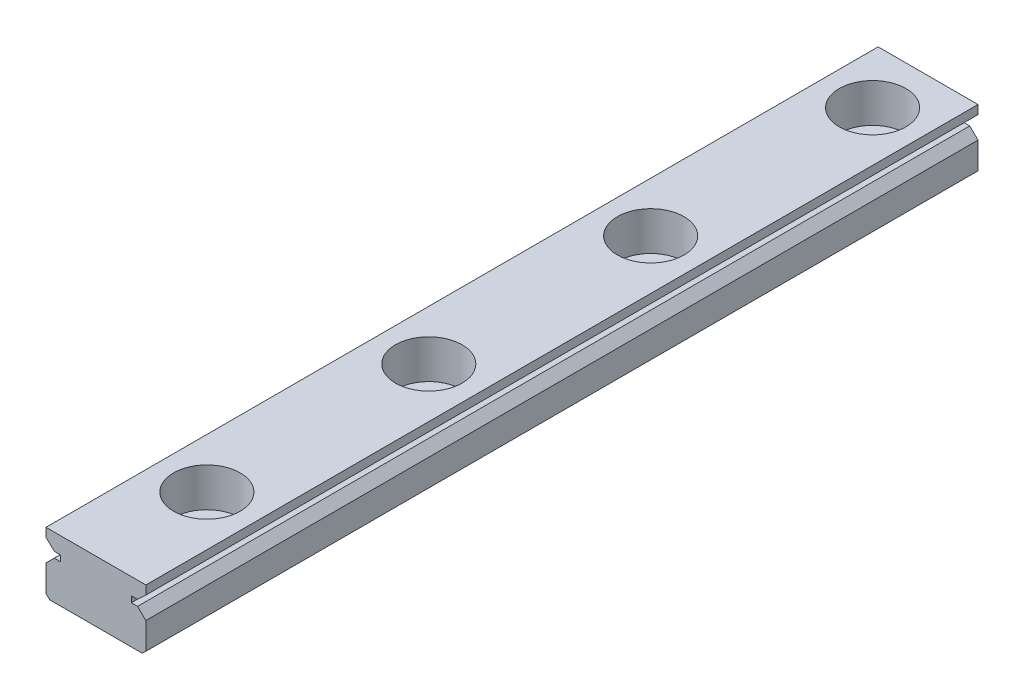
ISO-10303-21;
HEADER;
FILE_DESCRIPTION(('STEP AP214'),'2;1');
FILE_NAME('part.step','',(''),(''),'','','');
FILE_SCHEMA(('AUTOMOTIVE_DESIGN { 1 0 10303 214 1 1 1 1 }'));
ENDSEC;
DATA;
#1=APPLICATION_CONTEXT('core data for automotive mechanical design processes');
#2=APPLICATION_PROTOCOL_DEFINITION('international standard','automotive_design',2000,#1);
#3=PRODUCT_CONTEXT('',#1,'mechanical');
#4=PRODUCT('Part','Part','',(#3));
#5=PRODUCT_RELATED_PRODUCT_CATEGORY('part','',(#4));
#6=PRODUCT_DEFINITION_FORMATION('','',#4);
#7=PRODUCT_DEFINITION_CONTEXT('part definition',#1,'design');
#8=PRODUCT_DEFINITION('design','',#6,#7);
#9=PRODUCT_DEFINITION_SHAPE('','',#8);
#10=(LENGTH_UNIT() NAMED_UNIT(*) SI_UNIT(.MILLI.,.METRE.));
#11=(NAMED_UNIT(*) PLANE_ANGLE_UNIT() SI_UNIT($,.RADIAN.));
#12=(NAMED_UNIT(*) SI_UNIT($,.STERADIAN.) SOLID_ANGLE_UNIT());
#13=UNCERTAINTY_MEASURE_WITH_UNIT(LENGTH_MEASURE(1.E-05),#10,'distance_accuracy_value','');
#14=(GEOMETRIC_REPRESENTATION_CONTEXT(3) GLOBAL_UNCERTAINTY_ASSIGNED_CONTEXT((#13)) GLOBAL_UNIT_ASSIGNED_CONTEXT((#10,
#11,#12)) REPRESENTATION_CONTEXT('',''));
#15=CARTESIAN_POINT('',(0.,0.,0.));
#16=DIRECTION('',(0.,0.,1.));
#17=DIRECTION('',(1.,0.,0.));
#18=AXIS2_PLACEMENT_3D('',#15,#16,#17);
#19=CARTESIAN_POINT('',(0.,60.3558438126425,75.));
#20=DIRECTION('',(0.,-1.,0.));
#21=DIRECTION('',(0.,0.,-1.));
#22=AXIS2_PLACEMENT_3D('',#19,#20,#21);
#23=PLANE('',#22);
#24=CARTESIAN_POINT('',(176.62288373964,60.3558438126425,5.));
#25=DIRECTION('',(0.,1.,0.));
#26=DIRECTION('',(0.,0.,1.));
#27=AXIS2_PLACEMENT_3D('',#24,#25,#26);
#28=CIRCLE('',#27,3.);
#29=CARTESIAN_POINT('',(176.62288373964,60.3558438126425,8.));
#30=VERTEX_POINT('',#29);
#31=EDGE_CURVE('E342',#30,#30,#28,.T.);
#32=ORIENTED_EDGE('',*,*,#31,.F.);
#33=EDGE_LOOP('',(#32));
#34=FACE_BOUND('',#33,.T.);
#35=CARTESIAN_POINT('',(176.62288373964,60.3558438126425,25.));
#36=DIRECTION('',(0.,1.,0.));
#37=DIRECTION('',(0.,0.,1.));
#38=AXIS2_PLACEMENT_3D('',#35,#36,#37);
#39=CIRCLE('',#38,3.);
#40=CARTESIAN_POINT('',(176.62288373964,60.3558438126425,28.));
#41=VERTEX_POINT('',#40);
#42=EDGE_CURVE('E346',#41,#41,#39,.T.);
#43=ORIENTED_EDGE('',*,*,#42,.F.);
#44=EDGE_LOOP('',(#43));
#45=FACE_BOUND('',#44,.T.);
#46=CARTESIAN_POINT('',(176.62288373964,60.3558438126425,45.));
#47=DIRECTION('',(0.,1.,0.));
#48=DIRECTION('',(0.,0.,1.));
#49=AXIS2_PLACEMENT_3D('',#46,#47,#48);
#50=CIRCLE('',#49,3.);
#51=CARTESIAN_POINT('',(176.62288373964,60.3558438126425,48.));
#52=VERTEX_POINT('',#51);
#53=EDGE_CURVE('E350',#52,#52,#50,.T.);
#54=ORIENTED_EDGE('',*,*,#53,.F.);
#55=EDGE_LOOP('',(#54));
#56=FACE_BOUND('',#55,.T.);
#57=CARTESIAN_POINT('',(176.62288373964,60.3558438126425,65.));
#58=DIRECTION('',(0.,1.,0.));
#59=DIRECTION('',(0.,0.,1.));
#60=AXIS2_PLACEMENT_3D('',#57,#58,#59);
#61=CIRCLE('',#60,3.);
#62=CARTESIAN_POINT('',(176.62288373964,60.3558438126425,68.));
#63=VERTEX_POINT('',#62);
#64=EDGE_CURVE('E353',#63,#63,#61,.T.);
#65=ORIENTED_EDGE('',*,*,#64,.F.);
#66=EDGE_LOOP('',(#65));
#67=FACE_BOUND('',#66,.T.);
#68=DIRECTION('',(-1.,0.,0.));
#69=VECTOR('',#68,1.);
#70=CARTESIAN_POINT('',(0.,60.3558438126425,0.));
#71=LINE('',#70,#69);
#72=CARTESIAN_POINT('',(181.122753743396,60.3558438126425,0.));
#73=VERTEX_POINT('',#72);
#74=CARTESIAN_POINT('',(172.123013735885,60.3558438126425,0.));
#75=VERTEX_POINT('',#74);
#76=EDGE_CURVE('E187',#73,#75,#71,.T.);
#77=ORIENTED_EDGE('',*,*,#76,.T.);
#78=DIRECTION('',(0.,0.,-1.));
#79=VECTOR('',#78,1.);
#80=CARTESIAN_POINT('',(172.123013735885,60.3558438126425,75.));
#81=LINE('',#80,#79);
#82=CARTESIAN_POINT('',(172.123013735885,60.3558438126425,75.));
#83=VERTEX_POINT('',#82);
#84=EDGE_CURVE('E11',#83,#75,#81,.T.);
#85=ORIENTED_EDGE('',*,*,#84,.F.);
#86=DIRECTION('',(-1.,0.,0.));
#87=VECTOR('',#86,1.);
#88=CARTESIAN_POINT('',(0.,60.3558438126425,75.));
#89=LINE('',#88,#87);
#90=CARTESIAN_POINT('',(181.122753743396,60.3558438126425,75.));
#91=VERTEX_POINT('',#90);
#92=EDGE_CURVE('E118',#91,#83,#89,.T.);
#93=ORIENTED_EDGE('',*,*,#92,.F.);
#94=DIRECTION('',(0.,0.,-1.));
#95=VECTOR('',#94,1.);
#96=CARTESIAN_POINT('',(181.122753743396,60.3558438126425,75.));
#97=LINE('',#96,#95);
#98=EDGE_CURVE('E183',#91,#73,#97,.T.);
#99=ORIENTED_EDGE('',*,*,#98,.T.);
#100=EDGE_LOOP('',(#77,#85,#93,#99));
#101=FACE_BOUND('',#100,.T.);
#102=ADVANCED_FACE('F32',(#34,#45,#56,#67,#101),#23,.F.);
#103=CARTESIAN_POINT('',(172.123013735885,0.,75.));
#104=DIRECTION('',(-1.,0.,0.));
#105=DIRECTION('',(0.,0.,1.));
#106=AXIS2_PLACEMENT_3D('',#103,#104,#105);
#107=PLANE('',#106);
#108=DIRECTION('',(0.,1.,0.));
#109=VECTOR('',#108,1.);
#110=CARTESIAN_POINT('',(172.123013735885,0.,0.));
#111=LINE('',#110,#109);
#112=CARTESIAN_POINT('',(172.123013735885,59.5630289463369,0.));
#113=VERTEX_POINT('',#112);
#114=EDGE_CURVE('E190',#113,#75,#111,.T.);
#115=ORIENTED_EDGE('',*,*,#114,.F.);
#116=DIRECTION('',(0.,0.,-1.));
#117=VECTOR('',#116,1.);
#118=CARTESIAN_POINT('',(172.123013735885,59.5630289463369,75.));
#119=LINE('',#118,#117);
#120=CARTESIAN_POINT('',(172.123013735885,59.5630289463369,75.));
#121=VERTEX_POINT('',#120);
#122=EDGE_CURVE('E40',#121,#113,#119,.T.);
#123=ORIENTED_EDGE('',*,*,#122,.F.);
#124=DIRECTION('',(0.,1.,0.));
#125=VECTOR('',#124,1.);
#126=CARTESIAN_POINT('',(172.123013735885,0.,75.));
#127=LINE('',#126,#125);
#128=EDGE_CURVE('E283',#121,#83,#127,.T.);
#129=ORIENTED_EDGE('',*,*,#128,.T.);
#130=ORIENTED_EDGE('',*,*,#84,.T.);
#131=EDGE_LOOP('',(#115,#123,#129,#130));
#132=FACE_BOUND('',#131,.T.);
#133=ADVANCED_FACE('F270',(#132),#107,.T.);
#134=CARTESIAN_POINT('',(110.707011310501,117.452037908747,75.));
#135=DIRECTION('',(-0.685903044724634,-0.727692938839918,0.));
#136=DIRECTION('',(0.727692938839918,-0.685903044724634,0.));
#137=AXIS2_PLACEMENT_3D('',#134,#135,#136);
#138=PLANE('',#137);
#139=DIRECTION('',(-0.727692938839918,0.685903044724634,0.));
#140=VECTOR('',#139,1.);
#141=CARTESIAN_POINT('',(110.707011310501,117.452037908747,0.));
#142=LINE('',#141,#140);
#143=CARTESIAN_POINT('',(172.878991896515,58.8504650413625,0.));
#144=VERTEX_POINT('',#143);
#145=EDGE_CURVE('E194',#144,#113,#142,.T.);
#146=ORIENTED_EDGE('',*,*,#145,.F.);
#147=DIRECTION('',(0.,0.,-1.));
#148=VECTOR('',#147,1.);
#149=CARTESIAN_POINT('',(172.878991896515,58.8504650413625,75.));
#150=LINE('',#149,#148);
#151=CARTESIAN_POINT('',(172.878991896515,58.8504650413625,75.));
#152=VERTEX_POINT('',#151);
#153=EDGE_CURVE('E260',#152,#144,#150,.T.);
#154=ORIENTED_EDGE('',*,*,#153,.F.);
#155=DIRECTION('',(-0.727692938839918,0.685903044724634,0.));
#156=VECTOR('',#155,1.);
#157=CARTESIAN_POINT('',(110.707011310501,117.452037908747,75.));
#158=LINE('',#157,#156);
#159=EDGE_CURVE('E267',#152,#121,#158,.T.);
#160=ORIENTED_EDGE('',*,*,#159,.T.);
#161=ORIENTED_EDGE('',*,*,#122,.T.);
#162=EDGE_LOOP('',(#146,#154,#160,#161));
#163=FACE_BOUND('',#162,.T.);
#164=ADVANCED_FACE('F265',(#163),#138,.T.);
#165=CARTESIAN_POINT('',(0.,58.8504650413625,75.));
#166=DIRECTION('',(0.,-1.,0.));
#167=DIRECTION('',(0.,0.,-1.));
#168=AXIS2_PLACEMENT_3D('',#165,#166,#167);
#169=PLANE('',#168);
#170=DIRECTION('',(-1.,0.,0.));
#171=VECTOR('',#170,1.);
#172=CARTESIAN_POINT('',(0.,58.8504650413625,0.));
#173=LINE('',#172,#171);
#174=CARTESIAN_POINT('',(173.430975950309,58.8504650413625,0.));
#175=VERTEX_POINT('',#174);
#176=EDGE_CURVE('E197',#175,#144,#173,.T.);
#177=ORIENTED_EDGE('',*,*,#176,.F.);
#178=DIRECTION('',(0.,0.,-1.));
#179=VECTOR('',#178,1.);
#180=CARTESIAN_POINT('',(173.430975950309,58.8504650413625,75.));
#181=LINE('',#180,#179);
#182=CARTESIAN_POINT('',(173.430975950309,58.8504650413625,75.));
#183=VERTEX_POINT('',#182);
#184=EDGE_CURVE('E258',#183,#175,#181,.T.);
#185=ORIENTED_EDGE('',*,*,#184,.F.);
#186=DIRECTION('',(-1.,0.,0.));
#187=VECTOR('',#186,1.);
#188=CARTESIAN_POINT('',(0.,58.8504650413625,75.));
#189=LINE('',#188,#187);
#190=EDGE_CURVE('E280',#183,#152,#189,.T.);
#191=ORIENTED_EDGE('',*,*,#190,.T.);
#192=ORIENTED_EDGE('',*,*,#153,.T.);
#193=EDGE_LOOP('',(#177,#185,#191,#192));
#194=FACE_BOUND('',#193,.T.);
#195=ADVANCED_FACE('F277',(#194),#169,.T.);
#196=CARTESIAN_POINT('',(173.430975950309,0.,75.));
#197=DIRECTION('',(-1.,0.,0.));
#198=DIRECTION('',(0.,0.,1.));
#199=AXIS2_PLACEMENT_3D('',#196,#197,#198);
#200=PLANE('',#199);
#201=DIRECTION('',(0.,1.,0.));
#202=VECTOR('',#201,1.);
#203=CARTESIAN_POINT('',(173.430975950309,0.,0.));
#204=LINE('',#203,#202);
#205=CARTESIAN_POINT('',(173.430975950309,58.3136633089681,0.));
#206=VERTEX_POINT('',#205);
#207=EDGE_CURVE('E200',#206,#175,#204,.T.);
#208=ORIENTED_EDGE('',*,*,#207,.F.);
#209=DIRECTION('',(0.,0.,-1.));
#210=VECTOR('',#209,1.);
#211=CARTESIAN_POINT('',(173.430975950309,58.3136633089681,75.));
#212=LINE('',#211,#210);
#213=CARTESIAN_POINT('',(173.430975950309,58.3136633089681,75.));
#214=VERTEX_POINT('',#213);
#215=EDGE_CURVE('E256',#214,#206,#212,.T.);
#216=ORIENTED_EDGE('',*,*,#215,.F.);
#217=DIRECTION('',(0.,1.,0.));
#218=VECTOR('',#217,1.);
#219=CARTESIAN_POINT('',(173.430975950309,0.,75.));
#220=LINE('',#219,#218);
#221=EDGE_CURVE('E285',#214,#183,#220,.T.);
#222=ORIENTED_EDGE('',*,*,#221,.T.);
#223=ORIENTED_EDGE('',*,*,#184,.T.);
#224=EDGE_LOOP('',(#208,#216,#222,#223));
#225=FACE_BOUND('',#224,.T.);
#226=ADVANCED_FACE('F406',(#225),#200,.T.);
#227=CARTESIAN_POINT('',(0.,58.3136633089681,75.));
#228=DIRECTION('',(0.,1.,0.));
#229=DIRECTION('',(0.,0.,1.));
#230=AXIS2_PLACEMENT_3D('',#227,#228,#229);
#231=PLANE('',#230);
#232=DIRECTION('',(1.,0.,0.));
#233=VECTOR('',#232,1.);
#234=CARTESIAN_POINT('',(0.,58.3136633089681,0.));
#235=LINE('',#234,#233);
#236=CARTESIAN_POINT('',(172.866992243172,58.3136633089681,0.));
#237=VERTEX_POINT('',#236);
#238=EDGE_CURVE('E203',#237,#206,#235,.T.);
#239=ORIENTED_EDGE('',*,*,#238,.F.);
#240=DIRECTION('',(0.,0.,-1.));
#241=VECTOR('',#240,1.);
#242=CARTESIAN_POINT('',(172.866992243172,58.3136633089681,75.));
#243=LINE('',#242,#241);
#244=CARTESIAN_POINT('',(172.866992243172,58.3136633089681,75.));
#245=VERTEX_POINT('',#244);
#246=EDGE_CURVE('E254',#245,#237,#243,.T.);
#247=ORIENTED_EDGE('',*,*,#246,.F.);
#248=DIRECTION('',(1.,0.,0.));
#249=VECTOR('',#248,1.);
#250=CARTESIAN_POINT('',(0.,58.3136633089681,75.));
#251=LINE('',#250,#249);
#252=EDGE_CURVE('E291',#245,#214,#251,.T.);
#253=ORIENTED_EDGE('',*,*,#252,.T.);
#254=ORIENTED_EDGE('',*,*,#215,.T.);
#255=EDGE_LOOP('',(#239,#247,#253,#254));
#256=FACE_BOUND('',#255,.T.);
#257=ADVANCED_FACE('F403',(#256),#231,.T.);
#258=CARTESIAN_POINT('',(56.2293907047499,-56.9162890040398,75.));
#259=DIRECTION('',(-0.702801041807441,0.711386460114596,0.));
#260=DIRECTION('',(-0.711386460114596,-0.702801041807441,0.));
#261=AXIS2_PLACEMENT_3D('',#258,#259,#260);
#262=PLANE('',#261);
#263=DIRECTION('',(0.711386460114596,0.702801041807441,0.));
#264=VECTOR('',#263,1.);
#265=CARTESIAN_POINT('',(56.2293907047499,-56.9162890040398,0.));
#266=LINE('',#265,#264);
#267=CARTESIAN_POINT('',(172.123013735885,57.5786635594371,0.));
#268=VERTEX_POINT('',#267);
#269=EDGE_CURVE('E206',#268,#237,#266,.T.);
#270=ORIENTED_EDGE('',*,*,#269,.F.);
#271=DIRECTION('',(0.,0.,-1.));
#272=VECTOR('',#271,1.);
#273=CARTESIAN_POINT('',(172.123013735885,57.5786635594371,75.));
#274=LINE('',#273,#272);
#275=CARTESIAN_POINT('',(172.123013735885,57.5786635594371,75.));
#276=VERTEX_POINT('',#275);
#277=EDGE_CURVE('E252',#276,#268,#274,.T.);
#278=ORIENTED_EDGE('',*,*,#277,.F.);
#279=DIRECTION('',(0.711386460114596,0.702801041807441,0.));
#280=VECTOR('',#279,1.);
#281=CARTESIAN_POINT('',(56.2293907047499,-56.9162890040398,75.));
#282=LINE('',#281,#280);
#283=EDGE_CURVE('E294',#276,#245,#282,.T.);
#284=ORIENTED_EDGE('',*,*,#283,.T.);
#285=ORIENTED_EDGE('',*,*,#246,.T.);
#286=EDGE_LOOP('',(#270,#278,#284,#285));
#287=FACE_BOUND('',#286,.T.);
#288=ADVANCED_FACE('F400',(#287),#262,.T.);
#289=CARTESIAN_POINT('',(172.123013735885,0.,75.));
#290=DIRECTION('',(-1.,0.,0.));
#291=DIRECTION('',(0.,0.,1.));
#292=AXIS2_PLACEMENT_3D('',#289,#290,#291);
#293=PLANE('',#292);
#294=DIRECTION('',(0.,1.,0.));
#295=VECTOR('',#294,1.);
#296=CARTESIAN_POINT('',(172.123013735885,0.,0.));
#297=LINE('',#296,#295);
#298=CARTESIAN_POINT('',(172.123013735885,55.1745401347487,0.));
#299=VERTEX_POINT('',#298);
#300=EDGE_CURVE('E209',#299,#268,#297,.T.);
#301=ORIENTED_EDGE('',*,*,#300,.F.);
#302=DIRECTION('',(0.,0.,-1.));
#303=VECTOR('',#302,1.);
#304=CARTESIAN_POINT('',(172.123013735885,55.1745401347487,75.));
#305=LINE('',#304,#303);
#306=CARTESIAN_POINT('',(172.123013735885,55.1745401347487,75.));
#307=VERTEX_POINT('',#306);
#308=EDGE_CURVE('E250',#307,#299,#305,.T.);
#309=ORIENTED_EDGE('',*,*,#308,.F.);
#310=DIRECTION('',(0.,1.,0.));
#311=VECTOR('',#310,1.);
#312=CARTESIAN_POINT('',(172.123013735885,0.,75.));
#313=LINE('',#312,#311);
#314=EDGE_CURVE('E297',#307,#276,#313,.T.);
#315=ORIENTED_EDGE('',*,*,#314,.T.);
#316=ORIENTED_EDGE('',*,*,#277,.T.);
#317=EDGE_LOOP('',(#301,#309,#315,#316));
#318=FACE_BOUND('',#317,.T.);
#319=ADVANCED_FACE('F397',(#318),#293,.T.);
#320=CARTESIAN_POINT('',(105.735463596551,115.794842649279,75.));
#321=DIRECTION('',(0.674303230167207,0.738454571240554,0.));
#322=DIRECTION('',(-0.738454571240554,0.674303230167207,0.));
#323=AXIS2_PLACEMENT_3D('',#320,#321,#322);
#324=PLANE('',#323);
#325=DIRECTION('',(0.738454571240554,-0.674303230167207,0.));
#326=VECTOR('',#325,1.);
#327=CARTESIAN_POINT('',(105.735463596551,115.794842649279,0.));
#328=LINE('',#327,#326);
#329=CARTESIAN_POINT('',(172.467003798394,54.8604333239455,0.));
#330=VERTEX_POINT('',#329);
#331=EDGE_CURVE('E212',#299,#330,#328,.T.);
#332=ORIENTED_EDGE('',*,*,#331,.T.);
#333=DIRECTION('',(0.,0.,-1.));
#334=VECTOR('',#333,1.);
#335=CARTESIAN_POINT('',(172.467003798394,54.8604333239455,75.));
#336=LINE('',#335,#334);
#337=CARTESIAN_POINT('',(172.467003798394,54.8604333239455,75.));
#338=VERTEX_POINT('',#337);
#339=EDGE_CURVE('E248',#338,#330,#336,.T.);
#340=ORIENTED_EDGE('',*,*,#339,.F.);
#341=DIRECTION('',(0.738454571240554,-0.674303230167207,0.));
#342=VECTOR('',#341,1.);
#343=CARTESIAN_POINT('',(105.735463596551,115.794842649279,75.));
#344=LINE('',#343,#342);
#345=EDGE_CURVE('E300',#307,#338,#344,.T.);
#346=ORIENTED_EDGE('',*,*,#345,.F.);
#347=ORIENTED_EDGE('',*,*,#308,.T.);
#348=EDGE_LOOP('',(#332,#340,#346,#347));
#349=FACE_BOUND('',#348,.T.);
#350=ADVANCED_FACE('F377',(#349),#324,.F.);
#351=CARTESIAN_POINT('',(0.,54.8604333239455,75.));
#352=DIRECTION('',(0.,-1.,0.));
#353=DIRECTION('',(0.,0.,-1.));
#354=AXIS2_PLACEMENT_3D('',#351,#352,#353);
#355=PLANE('',#354);
#356=CARTESIAN_POINT('',(176.62288373964,54.8604333239455,5.));
#357=DIRECTION('',(0.,-1.,0.));
#358=DIRECTION('',(0.,0.,-1.));
#359=AXIS2_PLACEMENT_3D('',#356,#357,#358);
#360=CIRCLE('',#359,1.75);
#361=CARTESIAN_POINT('',(176.62288373964,54.8604333239455,3.25));
#362=VERTEX_POINT('',#361);
#363=EDGE_CURVE('E690',#362,#362,#360,.T.);
#364=ORIENTED_EDGE('',*,*,#363,.F.);
#365=EDGE_LOOP('',(#364));
#366=FACE_BOUND('',#365,.T.);
#367=CARTESIAN_POINT('',(176.62288373964,54.8604333239455,25.));
#368=DIRECTION('',(0.,-1.,0.));
#369=DIRECTION('',(0.,0.,-1.));
#370=AXIS2_PLACEMENT_3D('',#367,#368,#369);
#371=CIRCLE('',#370,1.75);
#372=CARTESIAN_POINT('',(176.62288373964,54.8604333239455,23.25));
#373=VERTEX_POINT('',#372);
#374=EDGE_CURVE('E700',#373,#373,#371,.T.);
#375=ORIENTED_EDGE('',*,*,#374,.F.);
#376=EDGE_LOOP('',(#375));
#377=FACE_BOUND('',#376,.T.);
#378=CARTESIAN_POINT('',(176.62288373964,54.8604333239455,45.));
#379=DIRECTION('',(0.,-1.,0.));
#380=DIRECTION('',(0.,0.,-1.));
#381=AXIS2_PLACEMENT_3D('',#378,#379,#380);
#382=CIRCLE('',#381,1.75);
#383=CARTESIAN_POINT('',(176.62288373964,54.8604333239455,43.25));
#384=VERTEX_POINT('',#383);
#385=EDGE_CURVE('E356',#384,#384,#382,.T.);
#386=ORIENTED_EDGE('',*,*,#385,.F.);
#387=EDGE_LOOP('',(#386));
#388=FACE_BOUND('',#387,.T.);
#389=CARTESIAN_POINT('',(176.62288373964,54.8604333239455,65.));
#390=DIRECTION('',(0.,-1.,0.));
#391=DIRECTION('',(0.,0.,-1.));
#392=AXIS2_PLACEMENT_3D('',#389,#390,#391);
#393=CIRCLE('',#392,1.75);
#394=CARTESIAN_POINT('',(176.62288373964,54.8604333239455,63.25));
#395=VERTEX_POINT('',#394);
#396=EDGE_CURVE('E191',#395,#395,#393,.T.);
#397=ORIENTED_EDGE('',*,*,#396,.F.);
#398=EDGE_LOOP('',(#397));
#399=FACE_BOUND('',#398,.T.);
#400=DIRECTION('',(-1.,0.,0.));
#401=VECTOR('',#400,1.);
#402=CARTESIAN_POINT('',(0.,54.8604333239455,0.));
#403=LINE('',#402,#401);
#404=CARTESIAN_POINT('',(180.778763680886,54.8604333239455,0.));
#405=VERTEX_POINT('',#404);
#406=EDGE_CURVE('E215',#405,#330,#403,.T.);
#407=ORIENTED_EDGE('',*,*,#406,.F.);
#408=DIRECTION('',(0.,0.,-1.));
#409=VECTOR('',#408,1.);
#410=CARTESIAN_POINT('',(180.778763680886,54.8604333239455,75.));
#411=LINE('',#410,#409);
#412=CARTESIAN_POINT('',(180.778763680886,54.8604333239455,75.));
#413=VERTEX_POINT('',#412);
#414=EDGE_CURVE('E246',#413,#405,#411,.T.);
#415=ORIENTED_EDGE('',*,*,#414,.F.);
#416=DIRECTION('',(-1.,0.,0.));
#417=VECTOR('',#416,1.);
#418=CARTESIAN_POINT('',(0.,54.8604333239455,75.));
#419=LINE('',#418,#417);
#420=EDGE_CURVE('E302',#413,#338,#419,.T.);
#421=ORIENTED_EDGE('',*,*,#420,.T.);
#422=ORIENTED_EDGE('',*,*,#339,.T.);
#423=EDGE_LOOP('',(#407,#415,#421,#422));
#424=FACE_BOUND('',#423,.T.);
#425=ADVANCED_FACE('F373',(#366,#377,#388,#399,#424),#355,.T.);
#426=CARTESIAN_POINT('',(54.880033865487,-60.101168235181,75.));
#427=DIRECTION('',(0.674303230167207,-0.738454571240554,0.));
#428=DIRECTION('',(0.738454571240554,0.674303230167207,0.));
#429=AXIS2_PLACEMENT_3D('',#426,#427,#428);
#430=PLANE('',#429);
#431=DIRECTION('',(-0.738454571240554,-0.674303230167207,0.));
#432=VECTOR('',#431,1.);
#433=CARTESIAN_POINT('',(54.880033865487,-60.101168235181,0.));
#434=LINE('',#433,#432);
#435=CARTESIAN_POINT('',(181.122753743396,55.1745401347487,0.));
#436=VERTEX_POINT('',#435);
#437=EDGE_CURVE('E218',#436,#405,#434,.T.);
#438=ORIENTED_EDGE('',*,*,#437,.F.);
#439=DIRECTION('',(0.,0.,-1.));
#440=VECTOR('',#439,1.);
#441=CARTESIAN_POINT('',(181.122753743396,55.1745401347487,75.));
#442=LINE('',#441,#440);
#443=CARTESIAN_POINT('',(181.122753743396,55.1745401347487,75.));
#444=VERTEX_POINT('',#443);
#445=EDGE_CURVE('E244',#444,#436,#442,.T.);
#446=ORIENTED_EDGE('',*,*,#445,.F.);
#447=DIRECTION('',(-0.738454571240554,-0.674303230167207,0.));
#448=VECTOR('',#447,1.);
#449=CARTESIAN_POINT('',(54.880033865487,-60.101168235181,75.));
#450=LINE('',#449,#448);
#451=EDGE_CURVE('E305',#444,#413,#450,.T.);
#452=ORIENTED_EDGE('',*,*,#451,.T.);
#453=ORIENTED_EDGE('',*,*,#414,.T.);
#454=EDGE_LOOP('',(#438,#446,#452,#453));
#455=FACE_BOUND('',#454,.T.);
#456=ADVANCED_FACE('F376',(#455),#430,.T.);
#457=CARTESIAN_POINT('',(181.122753743396,0.,75.));
#458=DIRECTION('',(-1.,0.,0.));
#459=DIRECTION('',(0.,0.,1.));
#460=AXIS2_PLACEMENT_3D('',#457,#458,#459);
#461=PLANE('',#460);
#462=DIRECTION('',(0.,1.,0.));
#463=VECTOR('',#462,1.);
#464=CARTESIAN_POINT('',(181.122753743396,0.,0.));
#465=LINE('',#464,#463);
#466=CARTESIAN_POINT('',(181.122753743396,57.5786635594371,0.));
#467=VERTEX_POINT('',#466);
#468=EDGE_CURVE('E221',#436,#467,#465,.T.);
#469=ORIENTED_EDGE('',*,*,#468,.T.);
#470=DIRECTION('',(0.,0.,-1.));
#471=VECTOR('',#470,1.);
#472=CARTESIAN_POINT('',(181.122753743396,57.5786635594371,75.));
#473=LINE('',#472,#471);
#474=CARTESIAN_POINT('',(181.122753743396,57.5786635594371,75.));
#475=VERTEX_POINT('',#474);
#476=EDGE_CURVE('E241',#475,#467,#473,.T.);
#477=ORIENTED_EDGE('',*,*,#476,.F.);
#478=DIRECTION('',(0.,1.,0.));
#479=VECTOR('',#478,1.);
#480=CARTESIAN_POINT('',(181.122753743396,0.,75.));
#481=LINE('',#480,#479);
#482=EDGE_CURVE('E308',#444,#475,#481,.T.);
#483=ORIENTED_EDGE('',*,*,#482,.F.);
#484=ORIENTED_EDGE('',*,*,#445,.T.);
#485=EDGE_LOOP('',(#469,#477,#483,#484));
#486=FACE_BOUND('',#485,.T.);
#487=ADVANCED_FACE('F469',(#486),#461,.F.);
#488=CARTESIAN_POINT('',(118.249294646824,119.693500080728,75.));
#489=DIRECTION('',(-0.702802016691502,-0.711385496994673,0.));
#490=DIRECTION('',(0.711385496994673,-0.702802016691502,0.));
#491=AXIS2_PLACEMENT_3D('',#488,#489,#490);
#492=PLANE('',#491);
#493=DIRECTION('',(-0.711385496994673,0.702802016691502,0.));
#494=VECTOR('',#493,1.);
#495=CARTESIAN_POINT('',(118.249294646824,119.693500080728,0.));
#496=LINE('',#495,#494);
#497=CARTESIAN_POINT('',(180.378777275353,58.3136633089681,0.));
#498=VERTEX_POINT('',#497);
#499=EDGE_CURVE('E223',#467,#498,#496,.T.);
#500=ORIENTED_EDGE('',*,*,#499,.T.);
#501=DIRECTION('',(0.,0.,-1.));
#502=VECTOR('',#501,1.);
#503=CARTESIAN_POINT('',(180.378777275353,58.3136633089681,75.));
#504=LINE('',#503,#502);
#505=CARTESIAN_POINT('',(180.378777275353,58.3136633089681,75.));
#506=VERTEX_POINT('',#505);
#507=EDGE_CURVE('E238',#506,#498,#504,.T.);
#508=ORIENTED_EDGE('',*,*,#507,.F.);
#509=DIRECTION('',(-0.711385496994673,0.702802016691502,0.));
#510=VECTOR('',#509,1.);
#511=CARTESIAN_POINT('',(118.249294646824,119.693500080728,75.));
#512=LINE('',#511,#510);
#513=EDGE_CURVE('E310',#475,#506,#512,.T.);
#514=ORIENTED_EDGE('',*,*,#513,.F.);
#515=ORIENTED_EDGE('',*,*,#476,.T.);
#516=EDGE_LOOP('',(#500,#508,#514,#515));
#517=FACE_BOUND('',#516,.T.);
#518=ADVANCED_FACE('F479',(#517),#492,.F.);
#519=CARTESIAN_POINT('',(0.,58.3136633089681,75.));
#520=DIRECTION('',(0.,-1.,0.));
#521=DIRECTION('',(0.,0.,-1.));
#522=AXIS2_PLACEMENT_3D('',#519,#520,#521);
#523=PLANE('',#522);
#524=DIRECTION('',(-1.,0.,0.));
#525=VECTOR('',#524,1.);
#526=CARTESIAN_POINT('',(0.,58.3136633089681,0.));
#527=LINE('',#526,#525);
#528=CARTESIAN_POINT('',(179.81479152897,58.3136633089681,0.));
#529=VERTEX_POINT('',#528);
#530=EDGE_CURVE('E225',#498,#529,#527,.T.);
#531=ORIENTED_EDGE('',*,*,#530,.T.);
#532=DIRECTION('',(0.,0.,-1.));
#533=VECTOR('',#532,1.);
#534=CARTESIAN_POINT('',(179.81479152897,58.3136633089681,75.));
#535=LINE('',#534,#533);
#536=CARTESIAN_POINT('',(179.81479152897,58.3136633089681,75.));
#537=VERTEX_POINT('',#536);
#538=EDGE_CURVE('E235',#537,#529,#535,.T.);
#539=ORIENTED_EDGE('',*,*,#538,.F.);
#540=DIRECTION('',(-1.,0.,0.));
#541=VECTOR('',#540,1.);
#542=CARTESIAN_POINT('',(0.,58.3136633089681,75.));
#543=LINE('',#542,#541);
#544=EDGE_CURVE('E312',#506,#537,#543,.T.);
#545=ORIENTED_EDGE('',*,*,#544,.F.);
#546=ORIENTED_EDGE('',*,*,#507,.T.);
#547=EDGE_LOOP('',(#531,#539,#545,#546));
#548=FACE_BOUND('',#547,.T.);
#549=ADVANCED_FACE('F318',(#548),#523,.F.);
#550=CARTESIAN_POINT('',(179.81479152897,0.,75.));
#551=DIRECTION('',(-1.,0.,0.));
#552=DIRECTION('',(0.,0.,1.));
#553=AXIS2_PLACEMENT_3D('',#550,#551,#552);
#554=PLANE('',#553);
#555=DIRECTION('',(0.,1.,0.));
#556=VECTOR('',#555,1.);
#557=CARTESIAN_POINT('',(179.81479152897,0.,0.));
#558=LINE('',#557,#556);
#559=CARTESIAN_POINT('',(179.81479152897,58.8504650413625,0.));
#560=VERTEX_POINT('',#559);
#561=EDGE_CURVE('E227',#529,#560,#558,.T.);
#562=ORIENTED_EDGE('',*,*,#561,.T.);
#563=DIRECTION('',(0.,0.,-1.));
#564=VECTOR('',#563,1.);
#565=CARTESIAN_POINT('',(179.81479152897,58.8504650413625,75.));
#566=LINE('',#565,#564);
#567=CARTESIAN_POINT('',(179.81479152897,58.8504650413625,75.));
#568=VERTEX_POINT('',#567);
#569=EDGE_CURVE('E178',#568,#560,#566,.T.);
#570=ORIENTED_EDGE('',*,*,#569,.F.);
#571=DIRECTION('',(0.,1.,0.));
#572=VECTOR('',#571,1.);
#573=CARTESIAN_POINT('',(179.81479152897,0.,75.));
#574=LINE('',#573,#572);
#575=EDGE_CURVE('E169',#537,#568,#574,.T.);
#576=ORIENTED_EDGE('',*,*,#575,.F.);
#577=ORIENTED_EDGE('',*,*,#538,.T.);
#578=EDGE_LOOP('',(#562,#570,#576,#577));
#579=FACE_BOUND('',#578,.T.);
#580=ADVANCED_FACE('F322',(#579),#554,.F.);
#581=CARTESIAN_POINT('',(0.,58.8504650413625,75.));
#582=DIRECTION('',(0.,1.,0.));
#583=DIRECTION('',(0.,0.,1.));
#584=AXIS2_PLACEMENT_3D('',#581,#582,#583);
#585=PLANE('',#584);
#586=DIRECTION('',(1.,0.,0.));
#587=VECTOR('',#586,1.);
#588=CARTESIAN_POINT('',(0.,58.8504650413625,0.));
#589=LINE('',#588,#587);
#590=CARTESIAN_POINT('',(180.366775582764,58.8504650413625,0.));
#591=VERTEX_POINT('',#590);
#592=EDGE_CURVE('E177',#560,#591,#589,.T.);
#593=ORIENTED_EDGE('',*,*,#592,.T.);
#594=DIRECTION('',(0.,0.,-1.));
#595=VECTOR('',#594,1.);
#596=CARTESIAN_POINT('',(180.366775582764,58.8504650413625,75.));
#597=LINE('',#596,#595);
#598=CARTESIAN_POINT('',(180.366775582764,58.8504650413625,75.));
#599=VERTEX_POINT('',#598);
#600=EDGE_CURVE('E174',#599,#591,#597,.T.);
#601=ORIENTED_EDGE('',*,*,#600,.F.);
#602=DIRECTION('',(1.,0.,0.));
#603=VECTOR('',#602,1.);
#604=CARTESIAN_POINT('',(0.,58.8504650413625,75.));
#605=LINE('',#604,#603);
#606=EDGE_CURVE('E163',#568,#599,#605,.T.);
#607=ORIENTED_EDGE('',*,*,#606,.F.);
#608=ORIENTED_EDGE('',*,*,#569,.T.);
#609=EDGE_LOOP('',(#593,#601,#607,#608));
#610=FACE_BOUND('',#609,.T.);
#611=ADVANCED_FACE('F175',(#610),#585,.F.);
#612=CARTESIAN_POINT('',(55.4820475190048,-58.8623924656534,75.));
#613=DIRECTION('',(-0.685903044724567,0.727692938839981,0.));
#614=DIRECTION('',(-0.727692938839981,-0.685903044724567,0.));
#615=AXIS2_PLACEMENT_3D('',#612,#613,#614);
#616=PLANE('',#615);
#617=DIRECTION('',(0.727692938839981,0.685903044724567,0.));
#618=VECTOR('',#617,1.);
#619=CARTESIAN_POINT('',(55.4820475190048,-58.8623924656534,0.));
#620=LINE('',#619,#618);
#621=CARTESIAN_POINT('',(181.122753743396,59.5630289463369,0.));
#622=VERTEX_POINT('',#621);
#623=EDGE_CURVE('E106',#591,#622,#620,.T.);
#624=ORIENTED_EDGE('',*,*,#623,.T.);
#625=DIRECTION('',(0.,0.,-1.));
#626=VECTOR('',#625,1.);
#627=CARTESIAN_POINT('',(181.122753743396,59.5630289463369,75.));
#628=LINE('',#627,#626);
#629=CARTESIAN_POINT('',(181.122753743396,59.5630289463369,75.));
#630=VERTEX_POINT('',#629);
#631=EDGE_CURVE('E179',#630,#622,#628,.T.);
#632=ORIENTED_EDGE('',*,*,#631,.F.);
#633=DIRECTION('',(0.727692938839981,0.685903044724567,0.));
#634=VECTOR('',#633,1.);
#635=CARTESIAN_POINT('',(55.4820475190048,-58.8623924656534,75.));
#636=LINE('',#635,#634);
#637=EDGE_CURVE('E167',#599,#630,#636,.T.);
#638=ORIENTED_EDGE('',*,*,#637,.F.);
#639=ORIENTED_EDGE('',*,*,#600,.T.);
#640=EDGE_LOOP('',(#624,#632,#638,#639));
#641=FACE_BOUND('',#640,.T.);
#642=ADVANCED_FACE('F181',(#641),#616,.F.);
#643=CARTESIAN_POINT('',(181.122753743396,0.,75.));
#644=DIRECTION('',(-1.,0.,0.));
#645=DIRECTION('',(0.,0.,1.));
#646=AXIS2_PLACEMENT_3D('',#643,#644,#645);
#647=PLANE('',#646);
#648=DIRECTION('',(0.,1.,0.));
#649=VECTOR('',#648,1.);
#650=CARTESIAN_POINT('',(181.122753743396,0.,0.));
#651=LINE('',#650,#649);
#652=EDGE_CURVE('E112',#622,#73,#651,.T.);
#653=ORIENTED_EDGE('',*,*,#652,.T.);
#654=ORIENTED_EDGE('',*,*,#98,.F.);
#655=DIRECTION('',(0.,1.,0.));
#656=VECTOR('',#655,1.);
#657=CARTESIAN_POINT('',(181.122753743396,0.,75.));
#658=LINE('',#657,#656);
#659=EDGE_CURVE('E48',#630,#91,#658,.T.);
#660=ORIENTED_EDGE('',*,*,#659,.F.);
#661=ORIENTED_EDGE('',*,*,#631,.T.);
#662=EDGE_LOOP('',(#653,#654,#660,#661));
#663=FACE_BOUND('',#662,.T.);
#664=ADVANCED_FACE('F324',(#663),#647,.F.);
#665=CARTESIAN_POINT('',(0.,0.,75.));
#666=DIRECTION('',(0.,0.,1.));
#667=DIRECTION('',(1.,0.,0.));
#668=AXIS2_PLACEMENT_3D('',#665,#666,#667);
#669=PLANE('',#668);
#670=ORIENTED_EDGE('',*,*,#92,.T.);
#671=ORIENTED_EDGE('',*,*,#128,.F.);
#672=ORIENTED_EDGE('',*,*,#159,.F.);
#673=ORIENTED_EDGE('',*,*,#190,.F.);
#674=ORIENTED_EDGE('',*,*,#221,.F.);
#675=ORIENTED_EDGE('',*,*,#252,.F.);
#676=ORIENTED_EDGE('',*,*,#283,.F.);
#677=ORIENTED_EDGE('',*,*,#314,.F.);
#678=ORIENTED_EDGE('',*,*,#345,.T.);
#679=ORIENTED_EDGE('',*,*,#420,.F.);
#680=ORIENTED_EDGE('',*,*,#451,.F.);
#681=ORIENTED_EDGE('',*,*,#482,.T.);
#682=ORIENTED_EDGE('',*,*,#513,.T.);
#683=ORIENTED_EDGE('',*,*,#544,.T.);
#684=ORIENTED_EDGE('',*,*,#575,.T.);
#685=ORIENTED_EDGE('',*,*,#606,.T.);
#686=ORIENTED_EDGE('',*,*,#637,.T.);
#687=ORIENTED_EDGE('',*,*,#659,.T.);
#688=EDGE_LOOP('',(#670,#671,#672,#673,#674,#675,#676,#677,#678,#679,#680,#681,#682,#683,#684,
#685,#686,#687));
#689=FACE_BOUND('',#688,.T.);
#690=ADVANCED_FACE('F165',(#689),#669,.T.);
#691=CARTESIAN_POINT('',(0.,0.,0.));
#692=DIRECTION('',(0.,0.,1.));
#693=DIRECTION('',(1.,0.,0.));
#694=AXIS2_PLACEMENT_3D('',#691,#692,#693);
#695=PLANE('',#694);
#696=ORIENTED_EDGE('',*,*,#76,.F.);
#697=ORIENTED_EDGE('',*,*,#652,.F.);
#698=ORIENTED_EDGE('',*,*,#623,.F.);
#699=ORIENTED_EDGE('',*,*,#592,.F.);
#700=ORIENTED_EDGE('',*,*,#561,.F.);
#701=ORIENTED_EDGE('',*,*,#530,.F.);
#702=ORIENTED_EDGE('',*,*,#499,.F.);
#703=ORIENTED_EDGE('',*,*,#468,.F.);
#704=ORIENTED_EDGE('',*,*,#437,.T.);
#705=ORIENTED_EDGE('',*,*,#406,.T.);
#706=ORIENTED_EDGE('',*,*,#331,.F.);
#707=ORIENTED_EDGE('',*,*,#300,.T.);
#708=ORIENTED_EDGE('',*,*,#269,.T.);
#709=ORIENTED_EDGE('',*,*,#238,.T.);
#710=ORIENTED_EDGE('',*,*,#207,.T.);
#711=ORIENTED_EDGE('',*,*,#176,.T.);
#712=ORIENTED_EDGE('',*,*,#145,.T.);
#713=ORIENTED_EDGE('',*,*,#114,.T.);
#714=EDGE_LOOP('',(#696,#697,#698,#699,#700,#701,#702,#703,#704,#705,#706,#707,#708,#709,#710,
#711,#712,#713));
#715=FACE_BOUND('',#714,.T.);
#716=ADVANCED_FACE('F273',(#715),#695,.F.);
#717=CARTESIAN_POINT('',(176.62288373964,60.3558438126425,65.));
#718=DIRECTION('',(0.,1.,0.));
#719=DIRECTION('',(0.,0.,1.));
#720=AXIS2_PLACEMENT_3D('',#717,#718,#719);
#721=CYLINDRICAL_SURFACE('',#720,1.75);
#722=CARTESIAN_POINT('',(176.62288373964,56.8558438126425,65.));
#723=DIRECTION('',(0.,1.,0.));
#724=DIRECTION('',(0.,0.,1.));
#725=AXIS2_PLACEMENT_3D('',#722,#723,#724);
#726=CIRCLE('',#725,1.75);
#727=CARTESIAN_POINT('',(176.62288373964,56.8558438126425,66.75));
#728=VERTEX_POINT('',#727);
#729=EDGE_CURVE('E359',#728,#728,#726,.T.);
#730=ORIENTED_EDGE('',*,*,#729,.T.);
#731=EDGE_LOOP('',(#730));
#732=FACE_BOUND('',#731,.T.);
#733=ORIENTED_EDGE('',*,*,#396,.T.);
#734=EDGE_LOOP('',(#733));
#735=FACE_BOUND('',#734,.T.);
#736=ADVANCED_FACE('F371',(#732,#735),#721,.F.);
#737=CARTESIAN_POINT('',(178.37288373964,56.8558438126425,65.));
#738=DIRECTION('',(0.,-1.,0.));
#739=DIRECTION('',(0.,0.,-1.));
#740=AXIS2_PLACEMENT_3D('',#737,#738,#739);
#741=PLANE('',#740);
#742=ORIENTED_EDGE('',*,*,#729,.F.);
#743=EDGE_LOOP('',(#742));
#744=FACE_BOUND('',#743,.T.);
#745=CARTESIAN_POINT('',(176.62288373964,56.8558438126425,65.));
#746=DIRECTION('',(0.,1.,0.));
#747=DIRECTION('',(0.,0.,1.));
#748=AXIS2_PLACEMENT_3D('',#745,#746,#747);
#749=CIRCLE('',#748,3.);
#750=CARTESIAN_POINT('',(176.62288373964,56.8558438126425,68.));
#751=VERTEX_POINT('',#750);
#752=EDGE_CURVE('E355',#751,#751,#749,.T.);
#753=ORIENTED_EDGE('',*,*,#752,.T.);
#754=EDGE_LOOP('',(#753));
#755=FACE_BOUND('',#754,.T.);
#756=ADVANCED_FACE('F566',(#744,#755),#741,.F.);
#757=CARTESIAN_POINT('',(176.62288373964,60.3558438126425,65.));
#758=DIRECTION('',(0.,1.,0.));
#759=DIRECTION('',(0.,0.,1.));
#760=AXIS2_PLACEMENT_3D('',#757,#758,#759);
#761=CYLINDRICAL_SURFACE('',#760,3.);
#762=ORIENTED_EDGE('',*,*,#752,.F.);
#763=EDGE_LOOP('',(#762));
#764=FACE_BOUND('',#763,.T.);
#765=ORIENTED_EDGE('',*,*,#64,.T.);
#766=EDGE_LOOP('',(#765));
#767=FACE_BOUND('',#766,.T.);
#768=ADVANCED_FACE('F576',(#764,#767),#761,.F.);
#769=CARTESIAN_POINT('',(176.62288373964,60.3558438126425,45.));
#770=DIRECTION('',(0.,1.,0.));
#771=DIRECTION('',(0.,0.,1.));
#772=AXIS2_PLACEMENT_3D('',#769,#770,#771);
#773=CYLINDRICAL_SURFACE('',#772,1.75);
#774=CARTESIAN_POINT('',(176.62288373964,56.8558438126425,45.));
#775=DIRECTION('',(0.,1.,0.));
#776=DIRECTION('',(0.,0.,1.));
#777=AXIS2_PLACEMENT_3D('',#774,#775,#776);
#778=CIRCLE('',#777,1.75);
#779=CARTESIAN_POINT('',(176.62288373964,56.8558438126425,46.75));
#780=VERTEX_POINT('',#779);
#781=EDGE_CURVE('E362',#780,#780,#778,.T.);
#782=ORIENTED_EDGE('',*,*,#781,.T.);
#783=EDGE_LOOP('',(#782));
#784=FACE_BOUND('',#783,.T.);
#785=ORIENTED_EDGE('',*,*,#385,.T.);
#786=EDGE_LOOP('',(#785));
#787=FACE_BOUND('',#786,.T.);
#788=ADVANCED_FACE('F586',(#784,#787),#773,.F.);
#789=CARTESIAN_POINT('',(178.37288373964,56.8558438126425,45.));
#790=DIRECTION('',(0.,-1.,0.));
#791=DIRECTION('',(0.,0.,-1.));
#792=AXIS2_PLACEMENT_3D('',#789,#790,#791);
#793=PLANE('',#792);
#794=ORIENTED_EDGE('',*,*,#781,.F.);
#795=EDGE_LOOP('',(#794));
#796=FACE_BOUND('',#795,.T.);
#797=CARTESIAN_POINT('',(176.62288373964,56.8558438126425,45.));
#798=DIRECTION('',(0.,1.,0.));
#799=DIRECTION('',(0.,0.,1.));
#800=AXIS2_PLACEMENT_3D('',#797,#798,#799);
#801=CIRCLE('',#800,3.);
#802=CARTESIAN_POINT('',(176.62288373964,56.8558438126425,48.));
#803=VERTEX_POINT('',#802);
#804=EDGE_CURVE('E704',#803,#803,#801,.T.);
#805=ORIENTED_EDGE('',*,*,#804,.T.);
#806=EDGE_LOOP('',(#805));
#807=FACE_BOUND('',#806,.T.);
#808=ADVANCED_FACE('F596',(#796,#807),#793,.F.);
#809=CARTESIAN_POINT('',(176.62288373964,60.3558438126425,45.));
#810=DIRECTION('',(0.,1.,0.));
#811=DIRECTION('',(0.,0.,1.));
#812=AXIS2_PLACEMENT_3D('',#809,#810,#811);
#813=CYLINDRICAL_SURFACE('',#812,3.);
#814=ORIENTED_EDGE('',*,*,#804,.F.);
#815=EDGE_LOOP('',(#814));
#816=FACE_BOUND('',#815,.T.);
#817=ORIENTED_EDGE('',*,*,#53,.T.);
#818=EDGE_LOOP('',(#817));
#819=FACE_BOUND('',#818,.T.);
#820=ADVANCED_FACE('F606',(#816,#819),#813,.F.);
#821=CARTESIAN_POINT('',(176.62288373964,60.3558438126425,25.));
#822=DIRECTION('',(0.,1.,0.));
#823=DIRECTION('',(0.,0.,1.));
#824=AXIS2_PLACEMENT_3D('',#821,#822,#823);
#825=CYLINDRICAL_SURFACE('',#824,1.75);
#826=CARTESIAN_POINT('',(176.62288373964,56.8558438126425,25.));
#827=DIRECTION('',(0.,1.,0.));
#828=DIRECTION('',(0.,0.,1.));
#829=AXIS2_PLACEMENT_3D('',#826,#827,#828);
#830=CIRCLE('',#829,1.75);
#831=CARTESIAN_POINT('',(176.62288373964,56.8558438126425,26.75));
#832=VERTEX_POINT('',#831);
#833=EDGE_CURVE('E697',#832,#832,#830,.T.);
#834=ORIENTED_EDGE('',*,*,#833,.T.);
#835=EDGE_LOOP('',(#834));
#836=FACE_BOUND('',#835,.T.);
#837=ORIENTED_EDGE('',*,*,#374,.T.);
#838=EDGE_LOOP('',(#837));
#839=FACE_BOUND('',#838,.T.);
#840=ADVANCED_FACE('F616',(#836,#839),#825,.F.);
#841=CARTESIAN_POINT('',(178.37288373964,56.8558438126425,25.));
#842=DIRECTION('',(0.,-1.,0.));
#843=DIRECTION('',(0.,0.,-1.));
#844=AXIS2_PLACEMENT_3D('',#841,#842,#843);
#845=PLANE('',#844);
#846=ORIENTED_EDGE('',*,*,#833,.F.);
#847=EDGE_LOOP('',(#846));
#848=FACE_BOUND('',#847,.T.);
#849=CARTESIAN_POINT('',(176.62288373964,56.8558438126425,25.));
#850=DIRECTION('',(0.,1.,0.));
#851=DIRECTION('',(0.,0.,1.));
#852=AXIS2_PLACEMENT_3D('',#849,#850,#851);
#853=CIRCLE('',#852,3.);
#854=CARTESIAN_POINT('',(176.62288373964,56.8558438126425,28.));
#855=VERTEX_POINT('',#854);
#856=EDGE_CURVE('E694',#855,#855,#853,.T.);
#857=ORIENTED_EDGE('',*,*,#856,.T.);
#858=EDGE_LOOP('',(#857));
#859=FACE_BOUND('',#858,.T.);
#860=ADVANCED_FACE('F626',(#848,#859),#845,.F.);
#861=CARTESIAN_POINT('',(176.62288373964,60.3558438126425,25.));
#862=DIRECTION('',(0.,1.,0.));
#863=DIRECTION('',(0.,0.,1.));
#864=AXIS2_PLACEMENT_3D('',#861,#862,#863);
#865=CYLINDRICAL_SURFACE('',#864,3.);
#866=ORIENTED_EDGE('',*,*,#856,.F.);
#867=EDGE_LOOP('',(#866));
#868=FACE_BOUND('',#867,.T.);
#869=ORIENTED_EDGE('',*,*,#42,.T.);
#870=EDGE_LOOP('',(#869));
#871=FACE_BOUND('',#870,.T.);
#872=ADVANCED_FACE('F636',(#868,#871),#865,.F.);
#873=CARTESIAN_POINT('',(176.62288373964,60.3558438126425,5.));
#874=DIRECTION('',(0.,1.,0.));
#875=DIRECTION('',(0.,0.,1.));
#876=AXIS2_PLACEMENT_3D('',#873,#874,#875);
#877=CYLINDRICAL_SURFACE('',#876,1.75);
#878=CARTESIAN_POINT('',(176.62288373964,56.8558438126425,5.));
#879=DIRECTION('',(0.,1.,0.));
#880=DIRECTION('',(0.,0.,1.));
#881=AXIS2_PLACEMENT_3D('',#878,#879,#880);
#882=CIRCLE('',#881,1.75);
#883=CARTESIAN_POINT('',(176.62288373964,56.8558438126425,6.75));
#884=VERTEX_POINT('',#883);
#885=EDGE_CURVE('E685',#884,#884,#882,.T.);
#886=ORIENTED_EDGE('',*,*,#885,.T.);
#887=EDGE_LOOP('',(#886));
#888=FACE_BOUND('',#887,.T.);
#889=ORIENTED_EDGE('',*,*,#363,.T.);
#890=EDGE_LOOP('',(#889));
#891=FACE_BOUND('',#890,.T.);
#892=ADVANCED_FACE('F646',(#888,#891),#877,.F.);
#893=CARTESIAN_POINT('',(178.37288373964,56.8558438126425,5.));
#894=DIRECTION('',(0.,-1.,0.));
#895=DIRECTION('',(0.,0.,-1.));
#896=AXIS2_PLACEMENT_3D('',#893,#894,#895);
#897=PLANE('',#896);
#898=ORIENTED_EDGE('',*,*,#885,.F.);
#899=EDGE_LOOP('',(#898));
#900=FACE_BOUND('',#899,.T.);
#901=CARTESIAN_POINT('',(176.62288373964,56.8558438126425,5.));
#902=DIRECTION('',(0.,1.,0.));
#903=DIRECTION('',(0.,0.,1.));
#904=AXIS2_PLACEMENT_3D('',#901,#902,#903);
#905=CIRCLE('',#904,3.);
#906=CARTESIAN_POINT('',(176.62288373964,56.8558438126425,8.));
#907=VERTEX_POINT('',#906);
#908=EDGE_CURVE('E683',#907,#907,#905,.T.);
#909=ORIENTED_EDGE('',*,*,#908,.T.);
#910=EDGE_LOOP('',(#909));
#911=FACE_BOUND('',#910,.T.);
#912=ADVANCED_FACE('F656',(#900,#911),#897,.F.);
#913=CARTESIAN_POINT('',(176.62288373964,60.3558438126425,5.));
#914=DIRECTION('',(0.,1.,0.));
#915=DIRECTION('',(0.,0.,1.));
#916=AXIS2_PLACEMENT_3D('',#913,#914,#915);
#917=CYLINDRICAL_SURFACE('',#916,3.);
#918=ORIENTED_EDGE('',*,*,#908,.F.);
#919=EDGE_LOOP('',(#918));
#920=FACE_BOUND('',#919,.T.);
#921=ORIENTED_EDGE('',*,*,#31,.T.);
#922=EDGE_LOOP('',(#921));
#923=FACE_BOUND('',#922,.T.);
#924=ADVANCED_FACE('F666',(#920,#923),#917,.F.);
#925=CLOSED_SHELL('',(#102,#133,#164,#195,#226,#257,#288,#319,#350,#425,#456,#487,#518,#549,
#580,#611,#642,#664,#690,#716,#736,#756,#768,#788,#808,#820,#840,#860,#872,#892,#912,#924));
#926=MANIFOLD_SOLID_BREP('B2',#925);
#927=ADVANCED_BREP_SHAPE_REPRESENTATION('',(#18,#926),#14);
#928=SHAPE_DEFINITION_REPRESENTATION(#9,#927);
ENDSEC;
END-ISO-10303-21;
